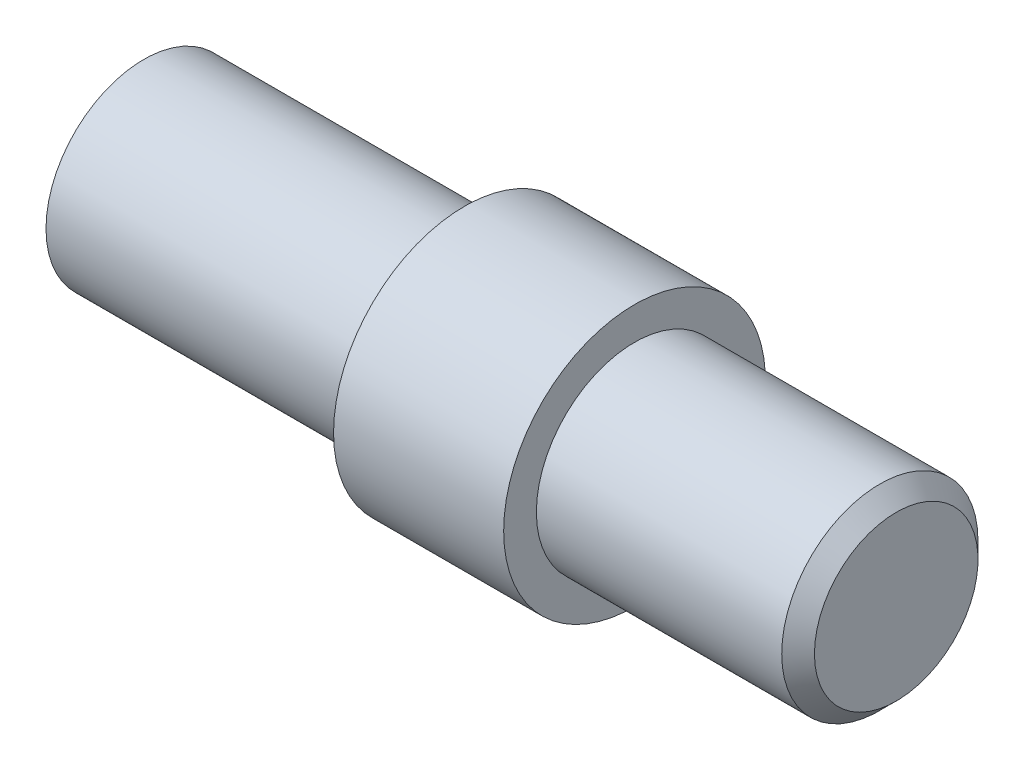
ISO-10303-21;
HEADER;
FILE_DESCRIPTION(('STEP AP214'),'2;1');
FILE_NAME('part.step','',(''),(''),'','','');
FILE_SCHEMA(('AUTOMOTIVE_DESIGN { 1 0 10303 214 1 1 1 1 }'));
ENDSEC;
DATA;
#1=APPLICATION_CONTEXT('core data for automotive mechanical design processes');
#2=APPLICATION_PROTOCOL_DEFINITION('international standard','automotive_design',2000,#1);
#3=PRODUCT_CONTEXT('',#1,'mechanical');
#4=PRODUCT('Part','Part','',(#3));
#5=PRODUCT_RELATED_PRODUCT_CATEGORY('part','',(#4));
#6=PRODUCT_DEFINITION_FORMATION('','',#4);
#7=PRODUCT_DEFINITION_CONTEXT('part definition',#1,'design');
#8=PRODUCT_DEFINITION('design','',#6,#7);
#9=PRODUCT_DEFINITION_SHAPE('','',#8);
#10=(LENGTH_UNIT() NAMED_UNIT(*) SI_UNIT(.MILLI.,.METRE.));
#11=(NAMED_UNIT(*) PLANE_ANGLE_UNIT() SI_UNIT($,.RADIAN.));
#12=(NAMED_UNIT(*) SI_UNIT($,.STERADIAN.) SOLID_ANGLE_UNIT());
#13=UNCERTAINTY_MEASURE_WITH_UNIT(LENGTH_MEASURE(1.E-05),#10,'distance_accuracy_value','');
#14=(GEOMETRIC_REPRESENTATION_CONTEXT(3) GLOBAL_UNCERTAINTY_ASSIGNED_CONTEXT((#13)) GLOBAL_UNIT_ASSIGNED_CONTEXT((#10,
#11,#12)) REPRESENTATION_CONTEXT('',''));
#15=CARTESIAN_POINT('',(0.,0.,0.));
#16=DIRECTION('',(0.,0.,1.));
#17=DIRECTION('',(1.,0.,0.));
#18=AXIS2_PLACEMENT_3D('',#15,#16,#17);
#19=CARTESIAN_POINT('',(0.,2.99,0.));
#20=DIRECTION('',(1.,0.,0.));
#21=DIRECTION('',(0.,0.,-1.));
#22=AXIS2_PLACEMENT_3D('',#19,#20,#21);
#23=PLANE('',#22);
#24=CARTESIAN_POINT('',(0.,0.,0.));
#25=DIRECTION('',(-1.,0.,0.));
#26=DIRECTION('',(0.,0.,1.));
#27=AXIS2_PLACEMENT_3D('',#24,#25,#26);
#28=CIRCLE('',#27,1.24999999999999);
#29=CARTESIAN_POINT('',(0.,0.,1.24999999999999));
#30=VERTEX_POINT('',#29);
#31=EDGE_CURVE('E53',#30,#30,#28,.T.);
#32=ORIENTED_EDGE('',*,*,#31,.F.);
#33=EDGE_LOOP('',(#32));
#34=FACE_BOUND('',#33,.T.);
#35=CARTESIAN_POINT('',(0.,0.,0.));
#36=DIRECTION('',(-1.,0.,0.));
#37=DIRECTION('',(0.,0.,1.));
#38=AXIS2_PLACEMENT_3D('',#35,#36,#37);
#39=CIRCLE('',#38,2.99);
#40=CARTESIAN_POINT('',(0.,0.,2.99));
#41=VERTEX_POINT('',#40);
#42=EDGE_CURVE('E52',#41,#41,#39,.T.);
#43=ORIENTED_EDGE('',*,*,#42,.T.);
#44=EDGE_LOOP('',(#43));
#45=FACE_BOUND('',#44,.T.);
#46=ADVANCED_FACE('F33',(#34,#45),#23,.F.);
#47=CARTESIAN_POINT('',(23.,0.,0.));
#48=DIRECTION('',(-1.,0.,0.));
#49=DIRECTION('',(0.,0.,1.));
#50=AXIS2_PLACEMENT_3D('',#47,#48,#49);
#51=PLANE('',#50);
#52=CARTESIAN_POINT('',(23.,0.,0.));
#53=DIRECTION('',(-1.,0.,0.));
#54=DIRECTION('',(0.,0.,1.));
#55=AXIS2_PLACEMENT_3D('',#52,#53,#54);
#56=CIRCLE('',#55,2.5);
#57=CARTESIAN_POINT('',(23.,0.,2.5));
#58=VERTEX_POINT('',#57);
#59=EDGE_CURVE('E11',#58,#58,#56,.F.);
#60=ORIENTED_EDGE('',*,*,#59,.T.);
#61=EDGE_LOOP('',(#60));
#62=FACE_BOUND('',#61,.T.);
#63=ADVANCED_FACE('F88',(#62),#51,.F.);
#64=CARTESIAN_POINT('',(0.,0.,0.));
#65=DIRECTION('',(-1.,0.,0.));
#66=DIRECTION('',(0.,0.,1.));
#67=AXIS2_PLACEMENT_3D('',#64,#65,#66);
#68=CYLINDRICAL_SURFACE('',#67,3.);
#69=CARTESIAN_POINT('',(22.5,0.,0.));
#70=DIRECTION('',(-1.,0.,0.));
#71=DIRECTION('',(0.,0.,1.));
#72=AXIS2_PLACEMENT_3D('',#69,#70,#71);
#73=CIRCLE('',#72,3.);
#74=CARTESIAN_POINT('',(22.5,0.,3.));
#75=VERTEX_POINT('',#74);
#76=EDGE_CURVE('E40',#75,#75,#73,.T.);
#77=ORIENTED_EDGE('',*,*,#76,.T.);
#78=EDGE_LOOP('',(#77));
#79=FACE_BOUND('',#78,.T.);
#80=CARTESIAN_POINT('',(15.,0.,0.));
#81=DIRECTION('',(-1.,0.,0.));
#82=DIRECTION('',(0.,0.,1.));
#83=AXIS2_PLACEMENT_3D('',#80,#81,#82);
#84=CIRCLE('',#83,3.);
#85=CARTESIAN_POINT('',(15.,0.,3.));
#86=VERTEX_POINT('',#85);
#87=EDGE_CURVE('E69',#86,#86,#84,.T.);
#88=ORIENTED_EDGE('',*,*,#87,.F.);
#89=EDGE_LOOP('',(#88));
#90=FACE_BOUND('',#89,.T.);
#91=ADVANCED_FACE('F74',(#79,#90),#68,.T.);
#92=CARTESIAN_POINT('',(15.,3.,0.));
#93=DIRECTION('',(-1.,0.,0.));
#94=DIRECTION('',(0.,0.,1.));
#95=AXIS2_PLACEMENT_3D('',#92,#93,#94);
#96=PLANE('',#95);
#97=CARTESIAN_POINT('',(15.,0.,0.));
#98=DIRECTION('',(-1.,0.,0.));
#99=DIRECTION('',(0.,0.,1.));
#100=AXIS2_PLACEMENT_3D('',#97,#98,#99);
#101=CIRCLE('',#100,4.);
#102=CARTESIAN_POINT('',(15.,0.,4.));
#103=VERTEX_POINT('',#102);
#104=EDGE_CURVE('E66',#103,#103,#101,.T.);
#105=ORIENTED_EDGE('',*,*,#104,.F.);
#106=EDGE_LOOP('',(#105));
#107=FACE_BOUND('',#106,.T.);
#108=ORIENTED_EDGE('',*,*,#87,.T.);
#109=EDGE_LOOP('',(#108));
#110=FACE_BOUND('',#109,.T.);
#111=ADVANCED_FACE('F100',(#107,#110),#96,.F.);
#112=CARTESIAN_POINT('',(0.,0.,0.));
#113=DIRECTION('',(-1.,0.,0.));
#114=DIRECTION('',(0.,0.,1.));
#115=AXIS2_PLACEMENT_3D('',#112,#113,#114);
#116=CYLINDRICAL_SURFACE('',#115,4.);
#117=CARTESIAN_POINT('',(9.8,0.,0.));
#118=DIRECTION('',(-1.,0.,0.));
#119=DIRECTION('',(0.,0.,1.));
#120=AXIS2_PLACEMENT_3D('',#117,#118,#119);
#121=CIRCLE('',#120,4.);
#122=CARTESIAN_POINT('',(9.8,0.,4.));
#123=VERTEX_POINT('',#122);
#124=EDGE_CURVE('E63',#123,#123,#121,.T.);
#125=ORIENTED_EDGE('',*,*,#124,.F.);
#126=EDGE_LOOP('',(#125));
#127=FACE_BOUND('',#126,.T.);
#128=ORIENTED_EDGE('',*,*,#104,.T.);
#129=EDGE_LOOP('',(#128));
#130=FACE_BOUND('',#129,.T.);
#131=ADVANCED_FACE('F103',(#127,#130),#116,.T.);
#132=CARTESIAN_POINT('',(9.8,4.,0.));
#133=DIRECTION('',(1.,0.,0.));
#134=DIRECTION('',(0.,0.,-1.));
#135=AXIS2_PLACEMENT_3D('',#132,#133,#134);
#136=PLANE('',#135);
#137=CARTESIAN_POINT('',(9.8,0.,0.));
#138=DIRECTION('',(-1.,0.,0.));
#139=DIRECTION('',(0.,0.,1.));
#140=AXIS2_PLACEMENT_3D('',#137,#138,#139);
#141=CIRCLE('',#140,2.99);
#142=CARTESIAN_POINT('',(9.8,0.,2.99));
#143=VERTEX_POINT('',#142);
#144=EDGE_CURVE('E56',#143,#143,#141,.T.);
#145=ORIENTED_EDGE('',*,*,#144,.F.);
#146=EDGE_LOOP('',(#145));
#147=FACE_BOUND('',#146,.T.);
#148=ORIENTED_EDGE('',*,*,#124,.T.);
#149=EDGE_LOOP('',(#148));
#150=FACE_BOUND('',#149,.T.);
#151=ADVANCED_FACE('F83',(#147,#150),#136,.F.);
#152=CARTESIAN_POINT('',(0.,0.,0.));
#153=DIRECTION('',(-1.,0.,0.));
#154=DIRECTION('',(0.,0.,1.));
#155=AXIS2_PLACEMENT_3D('',#152,#153,#154);
#156=CYLINDRICAL_SURFACE('',#155,2.99);
#157=ORIENTED_EDGE('',*,*,#42,.F.);
#158=EDGE_LOOP('',(#157));
#159=FACE_BOUND('',#158,.T.);
#160=ORIENTED_EDGE('',*,*,#144,.T.);
#161=EDGE_LOOP('',(#160));
#162=FACE_BOUND('',#161,.T.);
#163=ADVANCED_FACE('F78',(#159,#162),#156,.T.);
#164=CARTESIAN_POINT('',(22.5,0.,0.));
#165=DIRECTION('',(-1.,0.,0.));
#166=DIRECTION('',(0.,0.,1.));
#167=AXIS2_PLACEMENT_3D('',#164,#165,#166);
#168=CONICAL_SURFACE('',#167,3.,0.785398163397452);
#169=ORIENTED_EDGE('',*,*,#59,.F.);
#170=EDGE_LOOP('',(#169));
#171=FACE_BOUND('',#170,.T.);
#172=ORIENTED_EDGE('',*,*,#76,.F.);
#173=EDGE_LOOP('',(#172));
#174=FACE_BOUND('',#173,.T.);
#175=ADVANCED_FACE('F35',(#171,#174),#168,.T.);
#176=CARTESIAN_POINT('',(6.,0.,0.));
#177=DIRECTION('',(-1.,0.,0.));
#178=DIRECTION('',(0.,0.,1.));
#179=AXIS2_PLACEMENT_3D('',#176,#177,#178);
#180=CONICAL_SURFACE('',#179,1.25,1.02974425867665);
#181=CARTESIAN_POINT('',(6.75107577378445,0.,0.));
#182=VERTEX_POINT('',#181);
#183=VERTEX_LOOP('',#182);
#184=FACE_BOUND('',#183,.T.);
#185=CARTESIAN_POINT('',(6.,0.,0.));
#186=DIRECTION('',(-1.,0.,0.));
#187=DIRECTION('',(0.,0.,1.));
#188=AXIS2_PLACEMENT_3D('',#185,#186,#187);
#189=CIRCLE('',#188,1.25);
#190=CARTESIAN_POINT('',(6.,0.,1.25));
#191=VERTEX_POINT('',#190);
#192=EDGE_CURVE('E50',#191,#191,#189,.T.);
#193=ORIENTED_EDGE('',*,*,#192,.T.);
#194=EDGE_LOOP('',(#193));
#195=FACE_BOUND('',#194,.T.);
#196=ADVANCED_FACE('F43',(#184,#195),#180,.F.);
#197=CARTESIAN_POINT('',(0.,0.,0.));
#198=DIRECTION('',(-1.,0.,0.));
#199=DIRECTION('',(0.,0.,1.));
#200=AXIS2_PLACEMENT_3D('',#197,#198,#199);
#201=CYLINDRICAL_SURFACE('',#200,1.24999999999999);
#202=ORIENTED_EDGE('',*,*,#192,.F.);
#203=EDGE_LOOP('',(#202));
#204=FACE_BOUND('',#203,.T.);
#205=ORIENTED_EDGE('',*,*,#31,.T.);
#206=EDGE_LOOP('',(#205));
#207=FACE_BOUND('',#206,.T.);
#208=ADVANCED_FACE('F46',(#204,#207),#201,.F.);
#209=CLOSED_SHELL('',(#46,#63,#91,#111,#131,#151,#163,#175,#196,#208));
#210=MANIFOLD_SOLID_BREP('B2',#209);
#211=ADVANCED_BREP_SHAPE_REPRESENTATION('',(#18,#210),#14);
#212=SHAPE_DEFINITION_REPRESENTATION(#9,#211);
ENDSEC;
END-ISO-10303-21;
